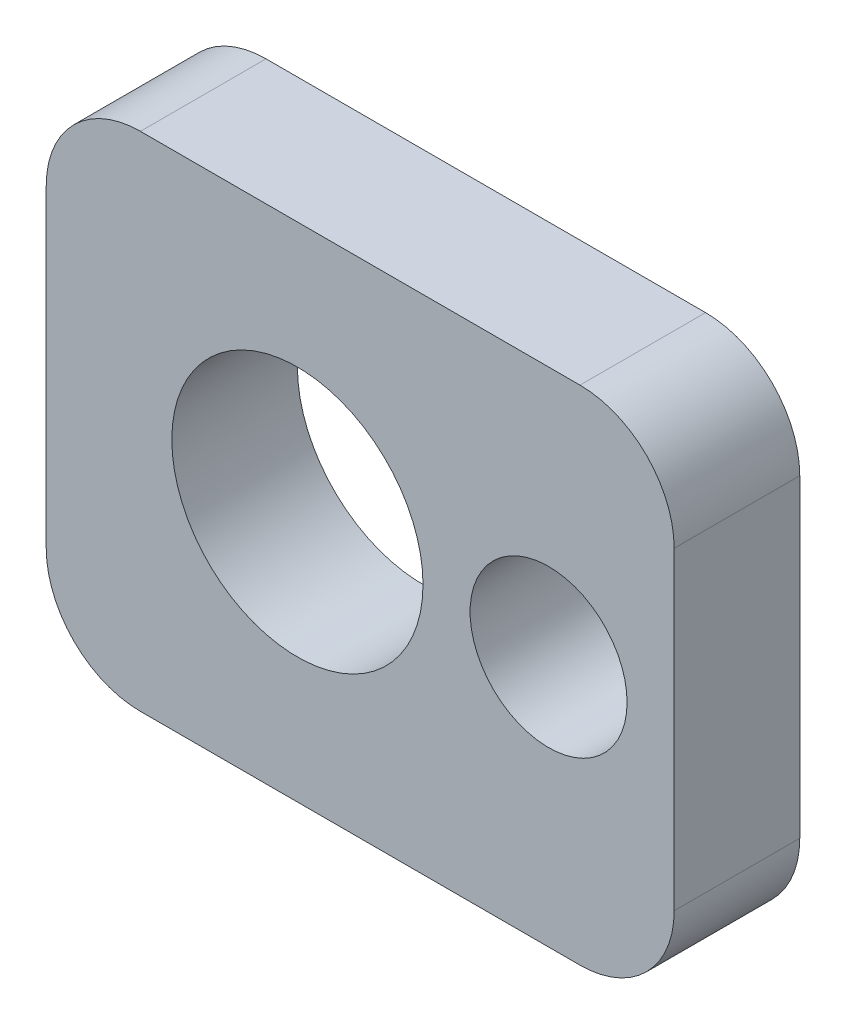
ISO-10303-21;
HEADER;
FILE_DESCRIPTION(('STEP AP214'),'2;1');
FILE_NAME('part.step','',(''),(''),'','','');
FILE_SCHEMA(('AUTOMOTIVE_DESIGN { 1 0 10303 214 1 1 1 1 }'));
ENDSEC;
DATA;
#1=APPLICATION_CONTEXT('core data for automotive mechanical design processes');
#2=APPLICATION_PROTOCOL_DEFINITION('international standard','automotive_design',2000,#1);
#3=PRODUCT_CONTEXT('',#1,'mechanical');
#4=PRODUCT('Part','Part','',(#3));
#5=PRODUCT_RELATED_PRODUCT_CATEGORY('part','',(#4));
#6=PRODUCT_DEFINITION_FORMATION('','',#4);
#7=PRODUCT_DEFINITION_CONTEXT('part definition',#1,'design');
#8=PRODUCT_DEFINITION('design','',#6,#7);
#9=PRODUCT_DEFINITION_SHAPE('','',#8);
#10=(LENGTH_UNIT() NAMED_UNIT(*) SI_UNIT(.MILLI.,.METRE.));
#11=(NAMED_UNIT(*) PLANE_ANGLE_UNIT() SI_UNIT($,.RADIAN.));
#12=(NAMED_UNIT(*) SI_UNIT($,.STERADIAN.) SOLID_ANGLE_UNIT());
#13=UNCERTAINTY_MEASURE_WITH_UNIT(LENGTH_MEASURE(1.E-05),#10,'distance_accuracy_value','');
#14=(GEOMETRIC_REPRESENTATION_CONTEXT(3) GLOBAL_UNCERTAINTY_ASSIGNED_CONTEXT((#13)) GLOBAL_UNIT_ASSIGNED_CONTEXT((#10,
#11,#12)) REPRESENTATION_CONTEXT('',''));
#15=CARTESIAN_POINT('',(0.,0.,0.));
#16=DIRECTION('',(0.,0.,1.));
#17=DIRECTION('',(1.,0.,0.));
#18=AXIS2_PLACEMENT_3D('',#15,#16,#17);
#19=CARTESIAN_POINT('',(-35.,-25.,20.));
#20=DIRECTION('',(0.,0.,-1.));
#21=DIRECTION('',(-1.,0.,0.));
#22=AXIS2_PLACEMENT_3D('',#19,#20,#21);
#23=CYLINDRICAL_SURFACE('',#22,15.);
#24=CARTESIAN_POINT('',(-35.,-25.,0.));
#25=DIRECTION('',(0.,0.,1.));
#26=DIRECTION('',(-1.,0.,0.));
#27=AXIS2_PLACEMENT_3D('',#24,#25,#26);
#28=CIRCLE('',#27,15.);
#29=CARTESIAN_POINT('',(-50.,-25.,0.));
#30=VERTEX_POINT('',#29);
#31=CARTESIAN_POINT('',(-35.,-40.,0.));
#32=VERTEX_POINT('',#31);
#33=EDGE_CURVE('E129',#30,#32,#28,.T.);
#34=ORIENTED_EDGE('',*,*,#33,.T.);
#35=DIRECTION('',(0.,0.,-1.));
#36=VECTOR('',#35,1.);
#37=CARTESIAN_POINT('',(-35.,-40.,20.));
#38=LINE('',#37,#36);
#39=CARTESIAN_POINT('',(-35.,-40.,20.));
#40=VERTEX_POINT('',#39);
#41=EDGE_CURVE('E11',#40,#32,#38,.T.);
#42=ORIENTED_EDGE('',*,*,#41,.F.);
#43=CARTESIAN_POINT('',(-35.,-25.,20.));
#44=DIRECTION('',(0.,0.,1.));
#45=DIRECTION('',(-1.,0.,0.));
#46=AXIS2_PLACEMENT_3D('',#43,#44,#45);
#47=CIRCLE('',#46,15.);
#48=CARTESIAN_POINT('',(-50.,-25.,20.));
#49=VERTEX_POINT('',#48);
#50=EDGE_CURVE('E144',#49,#40,#47,.T.);
#51=ORIENTED_EDGE('',*,*,#50,.F.);
#52=DIRECTION('',(0.,0.,-1.));
#53=VECTOR('',#52,1.);
#54=CARTESIAN_POINT('',(-50.,-25.,20.));
#55=LINE('',#54,#53);
#56=EDGE_CURVE('E125',#49,#30,#55,.T.);
#57=ORIENTED_EDGE('',*,*,#56,.T.);
#58=EDGE_LOOP('',(#34,#42,#51,#57));
#59=FACE_BOUND('',#58,.T.);
#60=ADVANCED_FACE('F33',(#59),#23,.T.);
#61=CARTESIAN_POINT('',(35.,-40.,20.));
#62=DIRECTION('',(0.,1.,0.));
#63=DIRECTION('',(0.,0.,1.));
#64=AXIS2_PLACEMENT_3D('',#61,#62,#63);
#65=PLANE('',#64);
#66=DIRECTION('',(1.,0.,0.));
#67=VECTOR('',#66,1.);
#68=CARTESIAN_POINT('',(35.,-40.,0.));
#69=LINE('',#68,#67);
#70=CARTESIAN_POINT('',(35.,-40.,0.));
#71=VERTEX_POINT('',#70);
#72=EDGE_CURVE('E132',#32,#71,#69,.T.);
#73=ORIENTED_EDGE('',*,*,#72,.T.);
#74=DIRECTION('',(0.,0.,-1.));
#75=VECTOR('',#74,1.);
#76=CARTESIAN_POINT('',(35.,-40.,20.));
#77=LINE('',#76,#75);
#78=CARTESIAN_POINT('',(35.,-40.,20.));
#79=VERTEX_POINT('',#78);
#80=EDGE_CURVE('E41',#79,#71,#77,.T.);
#81=ORIENTED_EDGE('',*,*,#80,.F.);
#82=DIRECTION('',(1.,0.,0.));
#83=VECTOR('',#82,1.);
#84=CARTESIAN_POINT('',(35.,-40.,20.));
#85=LINE('',#84,#83);
#86=EDGE_CURVE('E92',#40,#79,#85,.T.);
#87=ORIENTED_EDGE('',*,*,#86,.F.);
#88=ORIENTED_EDGE('',*,*,#41,.T.);
#89=EDGE_LOOP('',(#73,#81,#87,#88));
#90=FACE_BOUND('',#89,.T.);
#91=ADVANCED_FACE('F213',(#90),#65,.F.);
#92=CARTESIAN_POINT('',(35.,-25.,20.));
#93=DIRECTION('',(0.,0.,-1.));
#94=DIRECTION('',(-1.,0.,0.));
#95=AXIS2_PLACEMENT_3D('',#92,#93,#94);
#96=CYLINDRICAL_SURFACE('',#95,15.);
#97=CARTESIAN_POINT('',(35.,-25.,0.));
#98=DIRECTION('',(0.,0.,1.));
#99=DIRECTION('',(1.,0.,0.));
#100=AXIS2_PLACEMENT_3D('',#97,#98,#99);
#101=CIRCLE('',#100,15.);
#102=CARTESIAN_POINT('',(50.,-25.,0.));
#103=VERTEX_POINT('',#102);
#104=EDGE_CURVE('E135',#71,#103,#101,.T.);
#105=ORIENTED_EDGE('',*,*,#104,.T.);
#106=DIRECTION('',(0.,0.,-1.));
#107=VECTOR('',#106,1.);
#108=CARTESIAN_POINT('',(50.,-25.,20.));
#109=LINE('',#108,#107);
#110=CARTESIAN_POINT('',(50.,-25.,20.));
#111=VERTEX_POINT('',#110);
#112=EDGE_CURVE('E151',#111,#103,#109,.T.);
#113=ORIENTED_EDGE('',*,*,#112,.F.);
#114=CARTESIAN_POINT('',(35.,-25.,20.));
#115=DIRECTION('',(0.,0.,1.));
#116=DIRECTION('',(1.,0.,0.));
#117=AXIS2_PLACEMENT_3D('',#114,#115,#116);
#118=CIRCLE('',#117,15.);
#119=EDGE_CURVE('E159',#79,#111,#118,.T.);
#120=ORIENTED_EDGE('',*,*,#119,.F.);
#121=ORIENTED_EDGE('',*,*,#80,.T.);
#122=EDGE_LOOP('',(#105,#113,#120,#121));
#123=FACE_BOUND('',#122,.T.);
#124=ADVANCED_FACE('F157',(#123),#96,.T.);
#125=CARTESIAN_POINT('',(50.,-25.,20.));
#126=DIRECTION('',(-1.,0.,0.));
#127=DIRECTION('',(0.,0.,1.));
#128=AXIS2_PLACEMENT_3D('',#125,#126,#127);
#129=PLANE('',#128);
#130=DIRECTION('',(0.,1.,0.));
#131=VECTOR('',#130,1.);
#132=CARTESIAN_POINT('',(50.,-25.,0.));
#133=LINE('',#132,#131);
#134=CARTESIAN_POINT('',(50.,25.,0.));
#135=VERTEX_POINT('',#134);
#136=EDGE_CURVE('E137',#103,#135,#133,.T.);
#137=ORIENTED_EDGE('',*,*,#136,.T.);
#138=DIRECTION('',(0.,0.,-1.));
#139=VECTOR('',#138,1.);
#140=CARTESIAN_POINT('',(50.,25.,20.));
#141=LINE('',#140,#139);
#142=CARTESIAN_POINT('',(50.,25.,20.));
#143=VERTEX_POINT('',#142);
#144=EDGE_CURVE('E148',#143,#135,#141,.T.);
#145=ORIENTED_EDGE('',*,*,#144,.F.);
#146=DIRECTION('',(0.,1.,0.));
#147=VECTOR('',#146,1.);
#148=CARTESIAN_POINT('',(50.,-25.,20.));
#149=LINE('',#148,#147);
#150=EDGE_CURVE('E171',#111,#143,#149,.T.);
#151=ORIENTED_EDGE('',*,*,#150,.F.);
#152=ORIENTED_EDGE('',*,*,#112,.T.);
#153=EDGE_LOOP('',(#137,#145,#151,#152));
#154=FACE_BOUND('',#153,.T.);
#155=ADVANCED_FACE('F167',(#154),#129,.F.);
#156=CARTESIAN_POINT('',(35.,25.,20.));
#157=DIRECTION('',(0.,0.,-1.));
#158=DIRECTION('',(-1.,0.,0.));
#159=AXIS2_PLACEMENT_3D('',#156,#157,#158);
#160=CYLINDRICAL_SURFACE('',#159,15.);
#161=CARTESIAN_POINT('',(35.,25.,0.));
#162=DIRECTION('',(0.,0.,1.));
#163=DIRECTION('',(1.,0.,0.));
#164=AXIS2_PLACEMENT_3D('',#161,#162,#163);
#165=CIRCLE('',#164,15.);
#166=CARTESIAN_POINT('',(35.,40.,0.));
#167=VERTEX_POINT('',#166);
#168=EDGE_CURVE('E139',#135,#167,#165,.T.);
#169=ORIENTED_EDGE('',*,*,#168,.T.);
#170=DIRECTION('',(0.,0.,-1.));
#171=VECTOR('',#170,1.);
#172=CARTESIAN_POINT('',(35.,40.,20.));
#173=LINE('',#172,#171);
#174=CARTESIAN_POINT('',(35.,40.,20.));
#175=VERTEX_POINT('',#174);
#176=EDGE_CURVE('E120',#175,#167,#173,.T.);
#177=ORIENTED_EDGE('',*,*,#176,.F.);
#178=CARTESIAN_POINT('',(35.,25.,20.));
#179=DIRECTION('',(0.,0.,1.));
#180=DIRECTION('',(1.,0.,0.));
#181=AXIS2_PLACEMENT_3D('',#178,#179,#180);
#182=CIRCLE('',#181,15.);
#183=EDGE_CURVE('E111',#143,#175,#182,.T.);
#184=ORIENTED_EDGE('',*,*,#183,.F.);
#185=ORIENTED_EDGE('',*,*,#144,.T.);
#186=EDGE_LOOP('',(#169,#177,#184,#185));
#187=FACE_BOUND('',#186,.T.);
#188=ADVANCED_FACE('F170',(#187),#160,.T.);
#189=CARTESIAN_POINT('',(35.,40.,20.));
#190=DIRECTION('',(0.,-1.,0.));
#191=DIRECTION('',(1.,0.,0.));
#192=AXIS2_PLACEMENT_3D('',#189,#190,#191);
#193=PLANE('',#192);
#194=DIRECTION('',(-1.,0.,0.));
#195=VECTOR('',#194,1.);
#196=CARTESIAN_POINT('',(35.,40.,0.));
#197=LINE('',#196,#195);
#198=CARTESIAN_POINT('',(-35.,40.,0.));
#199=VERTEX_POINT('',#198);
#200=EDGE_CURVE('E119',#167,#199,#197,.T.);
#201=ORIENTED_EDGE('',*,*,#200,.T.);
#202=DIRECTION('',(0.,0.,-1.));
#203=VECTOR('',#202,1.);
#204=CARTESIAN_POINT('',(-35.,40.,20.));
#205=LINE('',#204,#203);
#206=CARTESIAN_POINT('',(-35.,40.,20.));
#207=VERTEX_POINT('',#206);
#208=EDGE_CURVE('E116',#207,#199,#205,.T.);
#209=ORIENTED_EDGE('',*,*,#208,.F.);
#210=DIRECTION('',(-1.,0.,0.));
#211=VECTOR('',#210,1.);
#212=CARTESIAN_POINT('',(35.,40.,20.));
#213=LINE('',#212,#211);
#214=EDGE_CURVE('E105',#175,#207,#213,.T.);
#215=ORIENTED_EDGE('',*,*,#214,.F.);
#216=ORIENTED_EDGE('',*,*,#176,.T.);
#217=EDGE_LOOP('',(#201,#209,#215,#216));
#218=FACE_BOUND('',#217,.T.);
#219=ADVANCED_FACE('F117',(#218),#193,.F.);
#220=CARTESIAN_POINT('',(-35.,25.,20.));
#221=DIRECTION('',(0.,0.,-1.));
#222=DIRECTION('',(-1.,0.,0.));
#223=AXIS2_PLACEMENT_3D('',#220,#221,#222);
#224=CYLINDRICAL_SURFACE('',#223,15.);
#225=CARTESIAN_POINT('',(-35.,25.,0.));
#226=DIRECTION('',(0.,0.,1.));
#227=DIRECTION('',(-1.,0.,0.));
#228=AXIS2_PLACEMENT_3D('',#225,#226,#227);
#229=CIRCLE('',#228,15.);
#230=CARTESIAN_POINT('',(-50.,25.,0.));
#231=VERTEX_POINT('',#230);
#232=EDGE_CURVE('E78',#199,#231,#229,.T.);
#233=ORIENTED_EDGE('',*,*,#232,.T.);
#234=DIRECTION('',(0.,0.,-1.));
#235=VECTOR('',#234,1.);
#236=CARTESIAN_POINT('',(-50.,25.,20.));
#237=LINE('',#236,#235);
#238=CARTESIAN_POINT('',(-50.,25.,20.));
#239=VERTEX_POINT('',#238);
#240=EDGE_CURVE('E121',#239,#231,#237,.T.);
#241=ORIENTED_EDGE('',*,*,#240,.F.);
#242=CARTESIAN_POINT('',(-35.,25.,20.));
#243=DIRECTION('',(0.,0.,1.));
#244=DIRECTION('',(-1.,0.,0.));
#245=AXIS2_PLACEMENT_3D('',#242,#243,#244);
#246=CIRCLE('',#245,15.);
#247=EDGE_CURVE('E109',#207,#239,#246,.T.);
#248=ORIENTED_EDGE('',*,*,#247,.F.);
#249=ORIENTED_EDGE('',*,*,#208,.T.);
#250=EDGE_LOOP('',(#233,#241,#248,#249));
#251=FACE_BOUND('',#250,.T.);
#252=ADVANCED_FACE('F123',(#251),#224,.T.);
#253=CARTESIAN_POINT('',(-50.,-25.,20.));
#254=DIRECTION('',(1.,0.,0.));
#255=DIRECTION('',(0.,1.,0.));
#256=AXIS2_PLACEMENT_3D('',#253,#254,#255);
#257=PLANE('',#256);
#258=DIRECTION('',(0.,-1.,0.));
#259=VECTOR('',#258,1.);
#260=CARTESIAN_POINT('',(-50.,-25.,0.));
#261=LINE('',#260,#259);
#262=EDGE_CURVE('E84',#231,#30,#261,.T.);
#263=ORIENTED_EDGE('',*,*,#262,.T.);
#264=ORIENTED_EDGE('',*,*,#56,.F.);
#265=DIRECTION('',(0.,-1.,0.));
#266=VECTOR('',#265,1.);
#267=CARTESIAN_POINT('',(-50.,-25.,20.));
#268=LINE('',#267,#266);
#269=EDGE_CURVE('E49',#239,#49,#268,.T.);
#270=ORIENTED_EDGE('',*,*,#269,.F.);
#271=ORIENTED_EDGE('',*,*,#240,.T.);
#272=EDGE_LOOP('',(#263,#264,#270,#271));
#273=FACE_BOUND('',#272,.T.);
#274=ADVANCED_FACE('F200',(#273),#257,.F.);
#275=CARTESIAN_POINT('',(-35.,-25.,20.));
#276=DIRECTION('',(0.,0.,-1.));
#277=DIRECTION('',(-1.,0.,0.));
#278=AXIS2_PLACEMENT_3D('',#275,#276,#277);
#279=PLANE('',#278);
#280=CARTESIAN_POINT('',(30.,0.,20.));
#281=DIRECTION('',(0.,0.,1.));
#282=DIRECTION('',(1.,0.,0.));
#283=AXIS2_PLACEMENT_3D('',#280,#281,#282);
#284=CIRCLE('',#283,12.5);
#285=CARTESIAN_POINT('',(42.5,0.,20.));
#286=VERTEX_POINT('',#285);
#287=EDGE_CURVE('E183',#286,#286,#284,.T.);
#288=ORIENTED_EDGE('',*,*,#287,.F.);
#289=EDGE_LOOP('',(#288));
#290=FACE_BOUND('',#289,.T.);
#291=CARTESIAN_POINT('',(-10.,0.,20.));
#292=DIRECTION('',(0.,0.,-1.));
#293=DIRECTION('',(-1.,0.,0.));
#294=AXIS2_PLACEMENT_3D('',#291,#292,#293);
#295=CIRCLE('',#294,20.);
#296=CARTESIAN_POINT('',(-30.,0.,20.));
#297=VERTEX_POINT('',#296);
#298=EDGE_CURVE('E133',#297,#297,#295,.T.);
#299=ORIENTED_EDGE('',*,*,#298,.T.);
#300=EDGE_LOOP('',(#299));
#301=FACE_BOUND('',#300,.T.);
#302=ORIENTED_EDGE('',*,*,#50,.T.);
#303=ORIENTED_EDGE('',*,*,#86,.T.);
#304=ORIENTED_EDGE('',*,*,#119,.T.);
#305=ORIENTED_EDGE('',*,*,#150,.T.);
#306=ORIENTED_EDGE('',*,*,#183,.T.);
#307=ORIENTED_EDGE('',*,*,#214,.T.);
#308=ORIENTED_EDGE('',*,*,#247,.T.);
#309=ORIENTED_EDGE('',*,*,#269,.T.);
#310=EDGE_LOOP('',(#302,#303,#304,#305,#306,#307,#308,#309));
#311=FACE_BOUND('',#310,.T.);
#312=ADVANCED_FACE('F107',(#290,#301,#311),#279,.F.);
#313=CARTESIAN_POINT('',(-35.,-25.,0.));
#314=DIRECTION('',(0.,0.,-1.));
#315=DIRECTION('',(-1.,0.,0.));
#316=AXIS2_PLACEMENT_3D('',#313,#314,#315);
#317=PLANE('',#316);
#318=CARTESIAN_POINT('',(30.,0.,0.));
#319=DIRECTION('',(0.,0.,1.));
#320=DIRECTION('',(1.,0.,0.));
#321=AXIS2_PLACEMENT_3D('',#318,#319,#320);
#322=CIRCLE('',#321,12.5);
#323=CARTESIAN_POINT('',(42.5,0.,0.));
#324=VERTEX_POINT('',#323);
#325=EDGE_CURVE('E182',#324,#324,#322,.T.);
#326=ORIENTED_EDGE('',*,*,#325,.T.);
#327=EDGE_LOOP('',(#326));
#328=FACE_BOUND('',#327,.T.);
#329=CARTESIAN_POINT('',(-10.,0.,0.));
#330=DIRECTION('',(0.,0.,1.));
#331=DIRECTION('',(1.,0.,0.));
#332=AXIS2_PLACEMENT_3D('',#329,#330,#331);
#333=CIRCLE('',#332,20.);
#334=CARTESIAN_POINT('',(10.,0.,0.));
#335=VERTEX_POINT('',#334);
#336=EDGE_CURVE('E179',#335,#335,#333,.T.);
#337=ORIENTED_EDGE('',*,*,#336,.T.);
#338=EDGE_LOOP('',(#337));
#339=FACE_BOUND('',#338,.T.);
#340=ORIENTED_EDGE('',*,*,#33,.F.);
#341=ORIENTED_EDGE('',*,*,#262,.F.);
#342=ORIENTED_EDGE('',*,*,#232,.F.);
#343=ORIENTED_EDGE('',*,*,#200,.F.);
#344=ORIENTED_EDGE('',*,*,#168,.F.);
#345=ORIENTED_EDGE('',*,*,#136,.F.);
#346=ORIENTED_EDGE('',*,*,#104,.F.);
#347=ORIENTED_EDGE('',*,*,#72,.F.);
#348=EDGE_LOOP('',(#340,#341,#342,#343,#344,#345,#346,#347));
#349=FACE_BOUND('',#348,.T.);
#350=ADVANCED_FACE('F163',(#328,#339,#349),#317,.T.);
#351=CARTESIAN_POINT('',(-10.,0.,0.));
#352=DIRECTION('',(0.,0.,1.));
#353=DIRECTION('',(1.,0.,0.));
#354=AXIS2_PLACEMENT_3D('',#351,#352,#353);
#355=CYLINDRICAL_SURFACE('',#354,20.);
#356=ORIENTED_EDGE('',*,*,#336,.F.);
#357=EDGE_LOOP('',(#356));
#358=FACE_BOUND('',#357,.T.);
#359=ORIENTED_EDGE('',*,*,#298,.F.);
#360=EDGE_LOOP('',(#359));
#361=FACE_BOUND('',#360,.T.);
#362=ADVANCED_FACE('F194',(#358,#361),#355,.F.);
#363=CARTESIAN_POINT('',(30.,0.,0.));
#364=DIRECTION('',(0.,0.,1.));
#365=DIRECTION('',(1.,0.,0.));
#366=AXIS2_PLACEMENT_3D('',#363,#364,#365);
#367=CYLINDRICAL_SURFACE('',#366,12.5);
#368=ORIENTED_EDGE('',*,*,#325,.F.);
#369=EDGE_LOOP('',(#368));
#370=FACE_BOUND('',#369,.T.);
#371=ORIENTED_EDGE('',*,*,#287,.T.);
#372=EDGE_LOOP('',(#371));
#373=FACE_BOUND('',#372,.T.);
#374=ADVANCED_FACE('F191',(#370,#373),#367,.F.);
#375=CLOSED_SHELL('',(#60,#91,#124,#155,#188,#219,#252,#274,#312,#350,#362,#374));
#376=MANIFOLD_SOLID_BREP('B2',#375);
#377=ADVANCED_BREP_SHAPE_REPRESENTATION('',(#18,#376),#14);
#378=SHAPE_DEFINITION_REPRESENTATION(#9,#377);
ENDSEC;
END-ISO-10303-21;
